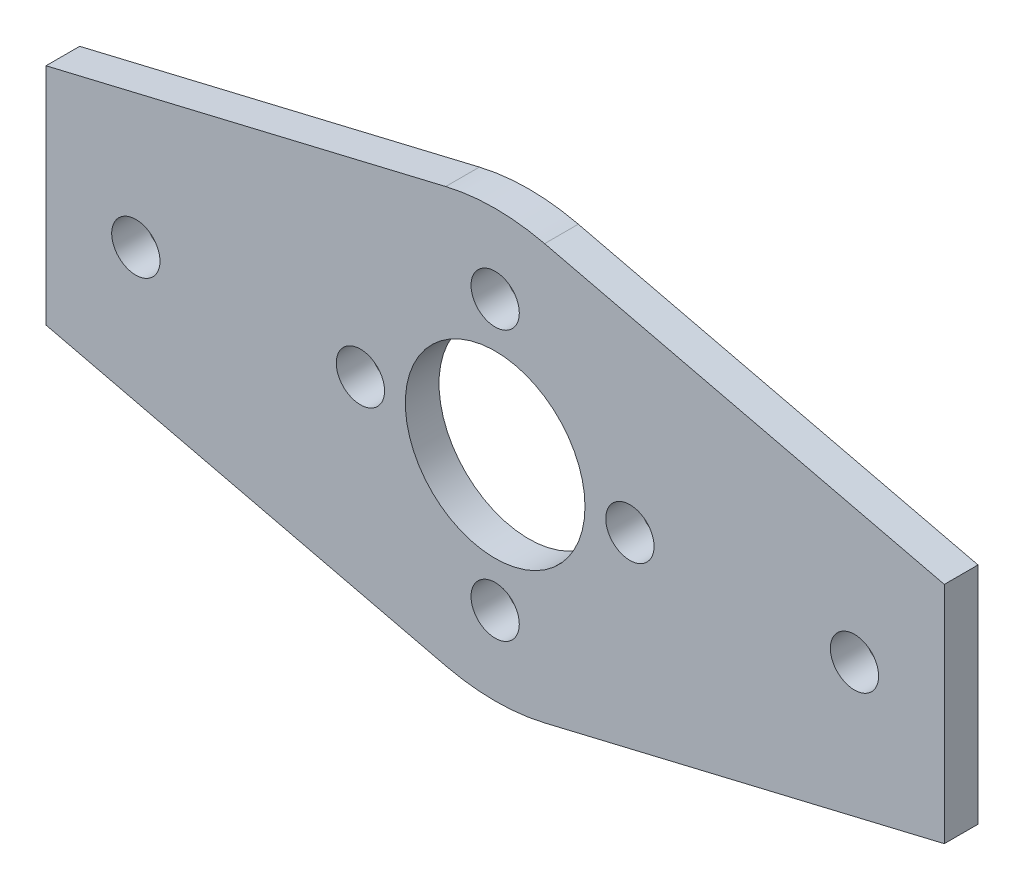
ISO-10303-21;
HEADER;
FILE_DESCRIPTION(('STEP AP214'),'2;1');
FILE_NAME('part.step','',(''),(''),'','','');
FILE_SCHEMA(('AUTOMOTIVE_DESIGN { 1 0 10303 214 1 1 1 1 }'));
ENDSEC;
DATA;
#1=APPLICATION_CONTEXT('core data for automotive mechanical design processes');
#2=APPLICATION_PROTOCOL_DEFINITION('international standard','automotive_design',2000,#1);
#3=PRODUCT_CONTEXT('',#1,'mechanical');
#4=PRODUCT('Part','Part','',(#3));
#5=PRODUCT_RELATED_PRODUCT_CATEGORY('part','',(#4));
#6=PRODUCT_DEFINITION_FORMATION('','',#4);
#7=PRODUCT_DEFINITION_CONTEXT('part definition',#1,'design');
#8=PRODUCT_DEFINITION('design','',#6,#7);
#9=PRODUCT_DEFINITION_SHAPE('','',#8);
#10=(LENGTH_UNIT() NAMED_UNIT(*) SI_UNIT(.MILLI.,.METRE.));
#11=(NAMED_UNIT(*) PLANE_ANGLE_UNIT() SI_UNIT($,.RADIAN.));
#12=(NAMED_UNIT(*) SI_UNIT($,.STERADIAN.) SOLID_ANGLE_UNIT());
#13=UNCERTAINTY_MEASURE_WITH_UNIT(LENGTH_MEASURE(1.E-05),#10,'distance_accuracy_value','');
#14=(GEOMETRIC_REPRESENTATION_CONTEXT(3) GLOBAL_UNCERTAINTY_ASSIGNED_CONTEXT((#13)) GLOBAL_UNIT_ASSIGNED_CONTEXT((#10,
#11,#12)) REPRESENTATION_CONTEXT('',''));
#15=CARTESIAN_POINT('',(0.,0.,0.));
#16=DIRECTION('',(0.,0.,1.));
#17=DIRECTION('',(1.,0.,0.));
#18=AXIS2_PLACEMENT_3D('',#15,#16,#17);
#19=CARTESIAN_POINT('',(-25.3658036981166,-274.741816004667,3.));
#20=DIRECTION('',(0.,0.,-1.));
#21=DIRECTION('',(-1.,0.,0.));
#22=AXIS2_PLACEMENT_3D('',#19,#20,#21);
#23=CYLINDRICAL_SURFACE('',#22,19.);
#24=CARTESIAN_POINT('',(-25.3658036981166,-274.741816004667,0.));
#25=DIRECTION('',(0.,0.,1.));
#26=DIRECTION('',(1.,0.,0.));
#27=AXIS2_PLACEMENT_3D('',#24,#25,#26);
#28=CIRCLE('',#27,19.);
#29=CARTESIAN_POINT('',(-29.7701882297977,-293.224277877943,0.));
#30=VERTEX_POINT('',#29);
#31=CARTESIAN_POINT('',(-20.9614191664356,-293.224277877942,0.));
#32=VERTEX_POINT('',#31);
#33=EDGE_CURVE('E156',#30,#32,#28,.T.);
#34=ORIENTED_EDGE('',*,*,#33,.T.);
#35=DIRECTION('',(0.,0.,-1.));
#36=VECTOR('',#35,1.);
#37=CARTESIAN_POINT('',(-20.9614191664356,-293.224277877942,3.));
#38=LINE('',#37,#36);
#39=CARTESIAN_POINT('',(-20.9614191664356,-293.224277877942,3.));
#40=VERTEX_POINT('',#39);
#41=EDGE_CURVE('E11',#40,#32,#38,.T.);
#42=ORIENTED_EDGE('',*,*,#41,.F.);
#43=CARTESIAN_POINT('',(-25.3658036981166,-274.741816004667,3.));
#44=DIRECTION('',(0.,0.,1.));
#45=DIRECTION('',(1.,0.,0.));
#46=AXIS2_PLACEMENT_3D('',#43,#44,#45);
#47=CIRCLE('',#46,19.);
#48=CARTESIAN_POINT('',(-29.7701882297977,-293.224277877943,3.));
#49=VERTEX_POINT('',#48);
#50=EDGE_CURVE('E93',#49,#40,#47,.T.);
#51=ORIENTED_EDGE('',*,*,#50,.F.);
#52=DIRECTION('',(0.,0.,-1.));
#53=VECTOR('',#52,1.);
#54=CARTESIAN_POINT('',(-29.7701882297977,-293.224277877943,3.));
#55=LINE('',#54,#53);
#56=EDGE_CURVE('E152',#49,#30,#55,.T.);
#57=ORIENTED_EDGE('',*,*,#56,.T.);
#58=EDGE_LOOP('',(#34,#42,#51,#57));
#59=FACE_BOUND('',#58,.T.);
#60=ADVANCED_FACE('F37',(#59),#23,.T.);
#61=CARTESIAN_POINT('',(64.9943725941574,-272.740948209282,3.));
#62=DIRECTION('',(0.23180971219374,-0.972761151225035,0.));
#63=DIRECTION('',(0.972761151225035,0.23180971219374,0.));
#64=AXIS2_PLACEMENT_3D('',#61,#62,#63);
#65=PLANE('',#64);
#66=DIRECTION('',(-0.972761151225035,-0.23180971219374,0.));
#67=VECTOR('',#66,1.);
#68=CARTESIAN_POINT('',(64.9943725941574,-272.740948209282,0.));
#69=LINE('',#68,#67);
#70=CARTESIAN_POINT('',(14.6341963018833,-284.741816004667,0.));
#71=VERTEX_POINT('',#70);
#72=EDGE_CURVE('E159',#71,#32,#69,.T.);
#73=ORIENTED_EDGE('',*,*,#72,.F.);
#74=DIRECTION('',(0.,0.,-1.));
#75=VECTOR('',#74,1.);
#76=CARTESIAN_POINT('',(14.6341963018833,-284.741816004667,3.));
#77=LINE('',#76,#75);
#78=CARTESIAN_POINT('',(14.6341963018833,-284.741816004667,3.));
#79=VERTEX_POINT('',#78);
#80=EDGE_CURVE('E46',#79,#71,#77,.T.);
#81=ORIENTED_EDGE('',*,*,#80,.F.);
#82=DIRECTION('',(-0.972761151225035,-0.23180971219374,0.));
#83=VECTOR('',#82,1.);
#84=CARTESIAN_POINT('',(64.9943725941574,-272.740948209282,3.));
#85=LINE('',#84,#83);
#86=EDGE_CURVE('E304',#79,#40,#85,.T.);
#87=ORIENTED_EDGE('',*,*,#86,.T.);
#88=ORIENTED_EDGE('',*,*,#41,.T.);
#89=EDGE_LOOP('',(#73,#81,#87,#88));
#90=FACE_BOUND('',#89,.T.);
#91=ADVANCED_FACE('F208',(#90),#65,.T.);
#92=CARTESIAN_POINT('',(14.6341963018841,0.,3.));
#93=DIRECTION('',(1.,0.,0.));
#94=DIRECTION('',(0.,1.,0.));
#95=AXIS2_PLACEMENT_3D('',#92,#93,#94);
#96=PLANE('',#95);
#97=DIRECTION('',(0.,-1.,0.));
#98=VECTOR('',#97,1.);
#99=CARTESIAN_POINT('',(14.6341963018841,0.,0.));
#100=LINE('',#99,#98);
#101=CARTESIAN_POINT('',(14.6341963018834,-264.741816004667,0.));
#102=VERTEX_POINT('',#101);
#103=EDGE_CURVE('E162',#102,#71,#100,.T.);
#104=ORIENTED_EDGE('',*,*,#103,.F.);
#105=DIRECTION('',(0.,0.,-1.));
#106=VECTOR('',#105,1.);
#107=CARTESIAN_POINT('',(14.6341963018834,-264.741816004667,3.));
#108=LINE('',#107,#106);
#109=CARTESIAN_POINT('',(14.6341963018834,-264.741816004667,3.));
#110=VERTEX_POINT('',#109);
#111=EDGE_CURVE('E198',#110,#102,#108,.T.);
#112=ORIENTED_EDGE('',*,*,#111,.F.);
#113=DIRECTION('',(0.,-1.,0.));
#114=VECTOR('',#113,1.);
#115=CARTESIAN_POINT('',(14.6341963018841,0.,3.));
#116=LINE('',#115,#114);
#117=EDGE_CURVE('E205',#110,#79,#116,.T.);
#118=ORIENTED_EDGE('',*,*,#117,.T.);
#119=ORIENTED_EDGE('',*,*,#80,.T.);
#120=EDGE_LOOP('',(#104,#112,#118,#119));
#121=FACE_BOUND('',#120,.T.);
#122=ADVANCED_FACE('F203',(#121),#96,.T.);
#123=CARTESIAN_POINT('',(-58.9117041309408,-247.21577275048,3.));
#124=DIRECTION('',(-0.231809712193743,-0.972761151225034,0.));
#125=DIRECTION('',(0.972761151225034,-0.231809712193743,0.));
#126=AXIS2_PLACEMENT_3D('',#123,#124,#125);
#127=PLANE('',#126);
#128=DIRECTION('',(-0.972761151225034,0.231809712193743,0.));
#129=VECTOR('',#128,1.);
#130=CARTESIAN_POINT('',(-58.9117041309408,-247.21577275048,0.));
#131=LINE('',#130,#129);
#132=CARTESIAN_POINT('',(-20.9614191664355,-256.259354131391,0.));
#133=VERTEX_POINT('',#132);
#134=EDGE_CURVE('E165',#102,#133,#131,.T.);
#135=ORIENTED_EDGE('',*,*,#134,.T.);
#136=DIRECTION('',(0.,0.,-1.));
#137=VECTOR('',#136,1.);
#138=CARTESIAN_POINT('',(-20.9614191664355,-256.259354131391,3.));
#139=LINE('',#138,#137);
#140=CARTESIAN_POINT('',(-20.9614191664355,-256.259354131391,3.));
#141=VERTEX_POINT('',#140);
#142=EDGE_CURVE('E195',#141,#133,#139,.T.);
#143=ORIENTED_EDGE('',*,*,#142,.F.);
#144=DIRECTION('',(-0.972761151225034,0.231809712193743,0.));
#145=VECTOR('',#144,1.);
#146=CARTESIAN_POINT('',(-58.9117041309408,-247.21577275048,3.));
#147=LINE('',#146,#145);
#148=EDGE_CURVE('E129',#110,#141,#147,.T.);
#149=ORIENTED_EDGE('',*,*,#148,.F.);
#150=ORIENTED_EDGE('',*,*,#111,.T.);
#151=EDGE_LOOP('',(#135,#143,#149,#150));
#152=FACE_BOUND('',#151,.T.);
#153=ADVANCED_FACE('F217',(#152),#127,.F.);
#154=CARTESIAN_POINT('',(-25.3658036981166,-274.741816004667,3.));
#155=DIRECTION('',(0.,0.,-1.));
#156=DIRECTION('',(-1.,0.,0.));
#157=AXIS2_PLACEMENT_3D('',#154,#155,#156);
#158=CYLINDRICAL_SURFACE('',#157,19.);
#159=CARTESIAN_POINT('',(-25.3658036981166,-274.741816004667,0.));
#160=DIRECTION('',(0.,0.,1.));
#161=DIRECTION('',(1.,0.,0.));
#162=AXIS2_PLACEMENT_3D('',#159,#160,#161);
#163=CIRCLE('',#162,19.);
#164=CARTESIAN_POINT('',(-29.7701882297978,-256.259354131391,0.));
#165=VERTEX_POINT('',#164);
#166=EDGE_CURVE('E167',#133,#165,#163,.T.);
#167=ORIENTED_EDGE('',*,*,#166,.T.);
#168=DIRECTION('',(0.,0.,-1.));
#169=VECTOR('',#168,1.);
#170=CARTESIAN_POINT('',(-29.7701882297978,-256.259354131391,3.));
#171=LINE('',#170,#169);
#172=CARTESIAN_POINT('',(-29.7701882297978,-256.259354131391,3.));
#173=VERTEX_POINT('',#172);
#174=EDGE_CURVE('E117',#173,#165,#171,.T.);
#175=ORIENTED_EDGE('',*,*,#174,.F.);
#176=CARTESIAN_POINT('',(-25.3658036981166,-274.741816004667,3.));
#177=DIRECTION('',(0.,0.,1.));
#178=DIRECTION('',(1.,0.,0.));
#179=AXIS2_PLACEMENT_3D('',#176,#177,#178);
#180=CIRCLE('',#179,19.);
#181=EDGE_CURVE('E126',#141,#173,#180,.T.);
#182=ORIENTED_EDGE('',*,*,#181,.F.);
#183=ORIENTED_EDGE('',*,*,#142,.T.);
#184=EDGE_LOOP('',(#167,#175,#182,#183));
#185=FACE_BOUND('',#184,.T.);
#186=ADVANCED_FACE('F220',(#185),#158,.T.);
#187=CARTESIAN_POINT('',(56.185603530796,-235.77602446273,3.));
#188=DIRECTION('',(-0.231809712193743,0.972761151225034,0.));
#189=DIRECTION('',(-0.972761151225034,-0.231809712193743,0.));
#190=AXIS2_PLACEMENT_3D('',#187,#188,#189);
#191=PLANE('',#190);
#192=DIRECTION('',(0.972761151225034,0.231809712193743,0.));
#193=VECTOR('',#192,1.);
#194=CARTESIAN_POINT('',(56.185603530796,-235.77602446273,0.));
#195=LINE('',#194,#193);
#196=CARTESIAN_POINT('',(-65.3658036981167,-264.741816004667,0.));
#197=VERTEX_POINT('',#196);
#198=EDGE_CURVE('E116',#197,#165,#195,.T.);
#199=ORIENTED_EDGE('',*,*,#198,.F.);
#200=DIRECTION('',(0.,0.,-1.));
#201=VECTOR('',#200,1.);
#202=CARTESIAN_POINT('',(-65.3658036981167,-264.741816004667,3.));
#203=LINE('',#202,#201);
#204=CARTESIAN_POINT('',(-65.3658036981167,-264.741816004667,3.));
#205=VERTEX_POINT('',#204);
#206=EDGE_CURVE('E110',#205,#197,#203,.T.);
#207=ORIENTED_EDGE('',*,*,#206,.F.);
#208=DIRECTION('',(0.972761151225034,0.231809712193743,0.));
#209=VECTOR('',#208,1.);
#210=CARTESIAN_POINT('',(56.185603530796,-235.77602446273,3.));
#211=LINE('',#210,#209);
#212=EDGE_CURVE('E114',#205,#173,#211,.T.);
#213=ORIENTED_EDGE('',*,*,#212,.T.);
#214=ORIENTED_EDGE('',*,*,#174,.T.);
#215=EDGE_LOOP('',(#199,#207,#213,#214));
#216=FACE_BOUND('',#215,.T.);
#217=ADVANCED_FACE('F112',(#216),#191,.T.);
#218=CARTESIAN_POINT('',(-65.3658036981174,-1.81426550721946E-13,3.));
#219=DIRECTION('',(1.,0.,0.));
#220=DIRECTION('',(0.,1.,0.));
#221=AXIS2_PLACEMENT_3D('',#218,#219,#220);
#222=PLANE('',#221);
#223=DIRECTION('',(0.,-1.,0.));
#224=VECTOR('',#223,1.);
#225=CARTESIAN_POINT('',(-65.3658036981174,-1.81426550721946E-13,0.));
#226=LINE('',#225,#224);
#227=CARTESIAN_POINT('',(-65.3658036981166,-284.741816004667,0.));
#228=VERTEX_POINT('',#227);
#229=EDGE_CURVE('E81',#197,#228,#226,.T.);
#230=ORIENTED_EDGE('',*,*,#229,.T.);
#231=DIRECTION('',(0.,0.,-1.));
#232=VECTOR('',#231,1.);
#233=CARTESIAN_POINT('',(-65.3658036981166,-284.741816004667,3.));
#234=LINE('',#233,#232);
#235=CARTESIAN_POINT('',(-65.3658036981166,-284.741816004667,3.));
#236=VERTEX_POINT('',#235);
#237=EDGE_CURVE('E118',#236,#228,#234,.T.);
#238=ORIENTED_EDGE('',*,*,#237,.F.);
#239=DIRECTION('',(0.,-1.,0.));
#240=VECTOR('',#239,1.);
#241=CARTESIAN_POINT('',(-65.3658036981174,-1.81426550721946E-13,3.));
#242=LINE('',#241,#240);
#243=EDGE_CURVE('E120',#205,#236,#242,.T.);
#244=ORIENTED_EDGE('',*,*,#243,.F.);
#245=ORIENTED_EDGE('',*,*,#206,.T.);
#246=EDGE_LOOP('',(#230,#238,#244,#245));
#247=FACE_BOUND('',#246,.T.);
#248=ADVANCED_FACE('F121',(#247),#222,.F.);
#249=CARTESIAN_POINT('',(6.63419630188337,-274.741816004667,3.));
#250=DIRECTION('',(0.,0.,-1.));
#251=DIRECTION('',(-1.,0.,0.));
#252=AXIS2_PLACEMENT_3D('',#249,#250,#251);
#253=CYLINDRICAL_SURFACE('',#252,2.15000000000001);
#254=CARTESIAN_POINT('',(6.63419630188337,-274.741816004667,3.));
#255=DIRECTION('',(0.,0.,1.));
#256=DIRECTION('',(1.,0.,0.));
#257=AXIS2_PLACEMENT_3D('',#254,#255,#256);
#258=CIRCLE('',#257,2.15000000000001);
#259=CARTESIAN_POINT('',(8.78419630188338,-274.741816004667,3.));
#260=VERTEX_POINT('',#259);
#261=EDGE_CURVE('E146',#260,#260,#258,.F.);
#262=ORIENTED_EDGE('',*,*,#261,.F.);
#263=EDGE_LOOP('',(#262));
#264=FACE_BOUND('',#263,.T.);
#265=CARTESIAN_POINT('',(6.63419630188337,-274.741816004667,0.));
#266=DIRECTION('',(0.,0.,1.));
#267=DIRECTION('',(1.,0.,0.));
#268=AXIS2_PLACEMENT_3D('',#265,#266,#267);
#269=CIRCLE('',#268,2.15000000000001);
#270=CARTESIAN_POINT('',(8.78419630188338,-274.741816004667,0.));
#271=VERTEX_POINT('',#270);
#272=EDGE_CURVE('E185',#271,#271,#269,.F.);
#273=ORIENTED_EDGE('',*,*,#272,.T.);
#274=EDGE_LOOP('',(#273));
#275=FACE_BOUND('',#274,.T.);
#276=ADVANCED_FACE('F250',(#264,#275),#253,.F.);
#277=CARTESIAN_POINT('',(-37.3658036981166,-274.741816004667,3.));
#278=DIRECTION('',(0.,0.,-1.));
#279=DIRECTION('',(-1.,0.,0.));
#280=AXIS2_PLACEMENT_3D('',#277,#278,#279);
#281=CYLINDRICAL_SURFACE('',#280,2.15);
#282=CARTESIAN_POINT('',(-37.3658036981166,-274.741816004667,3.));
#283=DIRECTION('',(0.,0.,1.));
#284=DIRECTION('',(1.,0.,0.));
#285=AXIS2_PLACEMENT_3D('',#282,#283,#284);
#286=CIRCLE('',#285,2.15);
#287=CARTESIAN_POINT('',(-35.2158036981166,-274.741816004667,3.));
#288=VERTEX_POINT('',#287);
#289=EDGE_CURVE('E143',#288,#288,#286,.T.);
#290=ORIENTED_EDGE('',*,*,#289,.T.);
#291=EDGE_LOOP('',(#290));
#292=FACE_BOUND('',#291,.T.);
#293=CARTESIAN_POINT('',(-37.3658036981166,-274.741816004667,0.));
#294=DIRECTION('',(0.,0.,1.));
#295=DIRECTION('',(1.,0.,0.));
#296=AXIS2_PLACEMENT_3D('',#293,#294,#295);
#297=CIRCLE('',#296,2.15);
#298=CARTESIAN_POINT('',(-35.2158036981166,-274.741816004667,0.));
#299=VERTEX_POINT('',#298);
#300=EDGE_CURVE('E182',#299,#299,#297,.T.);
#301=ORIENTED_EDGE('',*,*,#300,.F.);
#302=EDGE_LOOP('',(#301));
#303=FACE_BOUND('',#302,.T.);
#304=ADVANCED_FACE('F254',(#292,#303),#281,.F.);
#305=CARTESIAN_POINT('',(-57.3658036981167,-274.741816004667,3.));
#306=DIRECTION('',(0.,0.,-1.));
#307=DIRECTION('',(-1.,0.,0.));
#308=AXIS2_PLACEMENT_3D('',#305,#306,#307);
#309=CYLINDRICAL_SURFACE('',#308,2.15000000000001);
#310=CARTESIAN_POINT('',(-57.3658036981167,-274.741816004667,3.));
#311=DIRECTION('',(0.,0.,1.));
#312=DIRECTION('',(1.,0.,0.));
#313=AXIS2_PLACEMENT_3D('',#310,#311,#312);
#314=CIRCLE('',#313,2.15000000000001);
#315=CARTESIAN_POINT('',(-55.2158036981166,-274.741816004667,3.));
#316=VERTEX_POINT('',#315);
#317=EDGE_CURVE('E140',#316,#316,#314,.T.);
#318=ORIENTED_EDGE('',*,*,#317,.T.);
#319=EDGE_LOOP('',(#318));
#320=FACE_BOUND('',#319,.T.);
#321=CARTESIAN_POINT('',(-57.3658036981167,-274.741816004667,0.));
#322=DIRECTION('',(0.,0.,1.));
#323=DIRECTION('',(1.,0.,0.));
#324=AXIS2_PLACEMENT_3D('',#321,#322,#323);
#325=CIRCLE('',#324,2.15000000000001);
#326=CARTESIAN_POINT('',(-55.2158036981166,-274.741816004667,0.));
#327=VERTEX_POINT('',#326);
#328=EDGE_CURVE('E179',#327,#327,#325,.T.);
#329=ORIENTED_EDGE('',*,*,#328,.F.);
#330=EDGE_LOOP('',(#329));
#331=FACE_BOUND('',#330,.T.);
#332=ADVANCED_FACE('F260',(#320,#331),#309,.F.);
#333=CARTESIAN_POINT('',(-25.3658036981166,-274.741816004667,3.));
#334=DIRECTION('',(0.,0.,-1.));
#335=DIRECTION('',(-1.,0.,0.));
#336=AXIS2_PLACEMENT_3D('',#333,#334,#335);
#337=CYLINDRICAL_SURFACE('',#336,8.00000000000001);
#338=CARTESIAN_POINT('',(-25.3658036981166,-274.741816004667,3.));
#339=DIRECTION('',(0.,0.,1.));
#340=DIRECTION('',(1.,0.,0.));
#341=AXIS2_PLACEMENT_3D('',#338,#339,#340);
#342=CIRCLE('',#341,8.00000000000001);
#343=CARTESIAN_POINT('',(-17.3658036981166,-274.741816004667,3.));
#344=VERTEX_POINT('',#343);
#345=EDGE_CURVE('E137',#344,#344,#342,.T.);
#346=ORIENTED_EDGE('',*,*,#345,.T.);
#347=EDGE_LOOP('',(#346));
#348=FACE_BOUND('',#347,.T.);
#349=CARTESIAN_POINT('',(-25.3658036981166,-274.741816004667,0.));
#350=DIRECTION('',(0.,0.,1.));
#351=DIRECTION('',(1.,0.,0.));
#352=AXIS2_PLACEMENT_3D('',#349,#350,#351);
#353=CIRCLE('',#352,8.00000000000001);
#354=CARTESIAN_POINT('',(-17.3658036981166,-274.741816004667,0.));
#355=VERTEX_POINT('',#354);
#356=EDGE_CURVE('E176',#355,#355,#353,.T.);
#357=ORIENTED_EDGE('',*,*,#356,.F.);
#358=EDGE_LOOP('',(#357));
#359=FACE_BOUND('',#358,.T.);
#360=ADVANCED_FACE('F232',(#348,#359),#337,.F.);
#361=CARTESIAN_POINT('',(-25.3658036981166,-286.741816004667,3.));
#362=DIRECTION('',(0.,0.,-1.));
#363=DIRECTION('',(-1.,0.,0.));
#364=AXIS2_PLACEMENT_3D('',#361,#362,#363);
#365=CYLINDRICAL_SURFACE('',#364,2.15);
#366=CARTESIAN_POINT('',(-25.3658036981166,-286.741816004667,3.));
#367=DIRECTION('',(0.,0.,1.));
#368=DIRECTION('',(1.,0.,0.));
#369=AXIS2_PLACEMENT_3D('',#366,#367,#368);
#370=CIRCLE('',#369,2.15);
#371=CARTESIAN_POINT('',(-23.2158036981166,-286.741816004667,3.));
#372=VERTEX_POINT('',#371);
#373=EDGE_CURVE('E134',#372,#372,#370,.T.);
#374=ORIENTED_EDGE('',*,*,#373,.T.);
#375=EDGE_LOOP('',(#374));
#376=FACE_BOUND('',#375,.T.);
#377=CARTESIAN_POINT('',(-25.3658036981166,-286.741816004667,0.));
#378=DIRECTION('',(0.,0.,1.));
#379=DIRECTION('',(1.,0.,0.));
#380=AXIS2_PLACEMENT_3D('',#377,#378,#379);
#381=CIRCLE('',#380,2.15);
#382=CARTESIAN_POINT('',(-23.2158036981166,-286.741816004667,0.));
#383=VERTEX_POINT('',#382);
#384=EDGE_CURVE('E173',#383,#383,#381,.T.);
#385=ORIENTED_EDGE('',*,*,#384,.F.);
#386=EDGE_LOOP('',(#385));
#387=FACE_BOUND('',#386,.T.);
#388=ADVANCED_FACE('F224',(#376,#387),#365,.F.);
#389=CARTESIAN_POINT('',(-67.7204731943022,-284.180696497032,3.));
#390=DIRECTION('',(0.23180971219374,0.972761151225035,0.));
#391=DIRECTION('',(-0.972761151225035,0.23180971219374,0.));
#392=AXIS2_PLACEMENT_3D('',#389,#390,#391);
#393=PLANE('',#392);
#394=DIRECTION('',(0.972761151225035,-0.23180971219374,0.));
#395=VECTOR('',#394,1.);
#396=CARTESIAN_POINT('',(-67.7204731943022,-284.180696497032,0.));
#397=LINE('',#396,#395);
#398=EDGE_CURVE('E87',#228,#30,#397,.T.);
#399=ORIENTED_EDGE('',*,*,#398,.T.);
#400=ORIENTED_EDGE('',*,*,#56,.F.);
#401=DIRECTION('',(0.972761151225035,-0.23180971219374,0.));
#402=VECTOR('',#401,1.);
#403=CARTESIAN_POINT('',(-67.7204731943022,-284.180696497032,3.));
#404=LINE('',#403,#402);
#405=EDGE_CURVE('E54',#236,#49,#404,.T.);
#406=ORIENTED_EDGE('',*,*,#405,.F.);
#407=ORIENTED_EDGE('',*,*,#237,.T.);
#408=EDGE_LOOP('',(#399,#400,#406,#407));
#409=FACE_BOUND('',#408,.T.);
#410=ADVANCED_FACE('F222',(#409),#393,.F.);
#411=CARTESIAN_POINT('',(-25.3658036981166,-262.741816004667,3.));
#412=DIRECTION('',(0.,0.,-1.));
#413=DIRECTION('',(-1.,0.,0.));
#414=AXIS2_PLACEMENT_3D('',#411,#412,#413);
#415=CYLINDRICAL_SURFACE('',#414,2.15);
#416=CARTESIAN_POINT('',(-25.3658036981166,-262.741816004667,3.));
#417=DIRECTION('',(0.,0.,1.));
#418=DIRECTION('',(1.,0.,0.));
#419=AXIS2_PLACEMENT_3D('',#416,#417,#418);
#420=CIRCLE('',#419,2.15);
#421=CARTESIAN_POINT('',(-23.2158036981166,-262.741816004667,3.));
#422=VERTEX_POINT('',#421);
#423=EDGE_CURVE('E191',#422,#422,#420,.T.);
#424=ORIENTED_EDGE('',*,*,#423,.T.);
#425=EDGE_LOOP('',(#424));
#426=FACE_BOUND('',#425,.T.);
#427=CARTESIAN_POINT('',(-25.3658036981166,-262.741816004667,0.));
#428=DIRECTION('',(0.,0.,1.));
#429=DIRECTION('',(1.,0.,0.));
#430=AXIS2_PLACEMENT_3D('',#427,#428,#429);
#431=CIRCLE('',#430,2.15);
#432=CARTESIAN_POINT('',(-23.2158036981166,-262.741816004667,0.));
#433=VERTEX_POINT('',#432);
#434=EDGE_CURVE('E153',#433,#433,#431,.T.);
#435=ORIENTED_EDGE('',*,*,#434,.F.);
#436=EDGE_LOOP('',(#435));
#437=FACE_BOUND('',#436,.T.);
#438=ADVANCED_FACE('F39',(#426,#437),#415,.F.);
#439=CARTESIAN_POINT('',(-13.3658036981166,-274.741816004667,3.));
#440=DIRECTION('',(0.,0.,-1.));
#441=DIRECTION('',(-1.,0.,0.));
#442=AXIS2_PLACEMENT_3D('',#439,#440,#441);
#443=CYLINDRICAL_SURFACE('',#442,2.15);
#444=CARTESIAN_POINT('',(-13.3658036981166,-274.741816004667,3.));
#445=DIRECTION('',(0.,0.,1.));
#446=DIRECTION('',(1.,0.,0.));
#447=AXIS2_PLACEMENT_3D('',#444,#445,#446);
#448=CIRCLE('',#447,2.15);
#449=CARTESIAN_POINT('',(-11.2158036981166,-274.741816004667,3.));
#450=VERTEX_POINT('',#449);
#451=EDGE_CURVE('E149',#450,#450,#448,.F.);
#452=ORIENTED_EDGE('',*,*,#451,.F.);
#453=EDGE_LOOP('',(#452));
#454=FACE_BOUND('',#453,.T.);
#455=CARTESIAN_POINT('',(-13.3658036981166,-274.741816004667,0.));
#456=DIRECTION('',(0.,0.,1.));
#457=DIRECTION('',(1.,0.,0.));
#458=AXIS2_PLACEMENT_3D('',#455,#456,#457);
#459=CIRCLE('',#458,2.15);
#460=CARTESIAN_POINT('',(-11.2158036981166,-274.741816004667,0.));
#461=VERTEX_POINT('',#460);
#462=EDGE_CURVE('E188',#461,#461,#459,.F.);
#463=ORIENTED_EDGE('',*,*,#462,.T.);
#464=EDGE_LOOP('',(#463));
#465=FACE_BOUND('',#464,.T.);
#466=ADVANCED_FACE('F230',(#454,#465),#443,.F.);
#467=CARTESIAN_POINT('',(0.,0.,3.));
#468=DIRECTION('',(0.,0.,1.));
#469=DIRECTION('',(1.,0.,0.));
#470=AXIS2_PLACEMENT_3D('',#467,#468,#469);
#471=PLANE('',#470);
#472=ORIENTED_EDGE('',*,*,#423,.F.);
#473=EDGE_LOOP('',(#472));
#474=FACE_BOUND('',#473,.T.);
#475=ORIENTED_EDGE('',*,*,#50,.T.);
#476=ORIENTED_EDGE('',*,*,#86,.F.);
#477=ORIENTED_EDGE('',*,*,#117,.F.);
#478=ORIENTED_EDGE('',*,*,#148,.T.);
#479=ORIENTED_EDGE('',*,*,#181,.T.);
#480=ORIENTED_EDGE('',*,*,#212,.F.);
#481=ORIENTED_EDGE('',*,*,#243,.T.);
#482=ORIENTED_EDGE('',*,*,#405,.T.);
#483=EDGE_LOOP('',(#475,#476,#477,#478,#479,#480,#481,#482));
#484=FACE_BOUND('',#483,.T.);
#485=ORIENTED_EDGE('',*,*,#373,.F.);
#486=EDGE_LOOP('',(#485));
#487=FACE_BOUND('',#486,.T.);
#488=ORIENTED_EDGE('',*,*,#345,.F.);
#489=EDGE_LOOP('',(#488));
#490=FACE_BOUND('',#489,.T.);
#491=ORIENTED_EDGE('',*,*,#317,.F.);
#492=EDGE_LOOP('',(#491));
#493=FACE_BOUND('',#492,.T.);
#494=ORIENTED_EDGE('',*,*,#289,.F.);
#495=EDGE_LOOP('',(#494));
#496=FACE_BOUND('',#495,.T.);
#497=ORIENTED_EDGE('',*,*,#261,.T.);
#498=EDGE_LOOP('',(#497));
#499=FACE_BOUND('',#498,.T.);
#500=ORIENTED_EDGE('',*,*,#451,.T.);
#501=EDGE_LOOP('',(#500));
#502=FACE_BOUND('',#501,.T.);
#503=ADVANCED_FACE('F123',(#474,#484,#487,#490,#493,#496,#499,#502),#471,.T.);
#504=CARTESIAN_POINT('',(0.,0.,0.));
#505=DIRECTION('',(0.,0.,1.));
#506=DIRECTION('',(1.,0.,0.));
#507=AXIS2_PLACEMENT_3D('',#504,#505,#506);
#508=PLANE('',#507);
#509=ORIENTED_EDGE('',*,*,#434,.T.);
#510=EDGE_LOOP('',(#509));
#511=FACE_BOUND('',#510,.T.);
#512=ORIENTED_EDGE('',*,*,#33,.F.);
#513=ORIENTED_EDGE('',*,*,#398,.F.);
#514=ORIENTED_EDGE('',*,*,#229,.F.);
#515=ORIENTED_EDGE('',*,*,#198,.T.);
#516=ORIENTED_EDGE('',*,*,#166,.F.);
#517=ORIENTED_EDGE('',*,*,#134,.F.);
#518=ORIENTED_EDGE('',*,*,#103,.T.);
#519=ORIENTED_EDGE('',*,*,#72,.T.);
#520=EDGE_LOOP('',(#512,#513,#514,#515,#516,#517,#518,#519));
#521=FACE_BOUND('',#520,.T.);
#522=ORIENTED_EDGE('',*,*,#384,.T.);
#523=EDGE_LOOP('',(#522));
#524=FACE_BOUND('',#523,.T.);
#525=ORIENTED_EDGE('',*,*,#356,.T.);
#526=EDGE_LOOP('',(#525));
#527=FACE_BOUND('',#526,.T.);
#528=ORIENTED_EDGE('',*,*,#328,.T.);
#529=EDGE_LOOP('',(#528));
#530=FACE_BOUND('',#529,.T.);
#531=ORIENTED_EDGE('',*,*,#300,.T.);
#532=EDGE_LOOP('',(#531));
#533=FACE_BOUND('',#532,.T.);
#534=ORIENTED_EDGE('',*,*,#272,.F.);
#535=EDGE_LOOP('',(#534));
#536=FACE_BOUND('',#535,.T.);
#537=ORIENTED_EDGE('',*,*,#462,.F.);
#538=EDGE_LOOP('',(#537));
#539=FACE_BOUND('',#538,.T.);
#540=ADVANCED_FACE('F212',(#511,#521,#524,#527,#530,#533,#536,#539),#508,.F.);
#541=CLOSED_SHELL('',(#60,#91,#122,#153,#186,#217,#248,#276,#304,#332,#360,#388,#410,#438,#466,
#503,#540));
#542=MANIFOLD_SOLID_BREP('B2',#541);
#543=ADVANCED_BREP_SHAPE_REPRESENTATION('',(#18,#542),#14);
#544=SHAPE_DEFINITION_REPRESENTATION(#9,#543);
ENDSEC;
END-ISO-10303-21;
